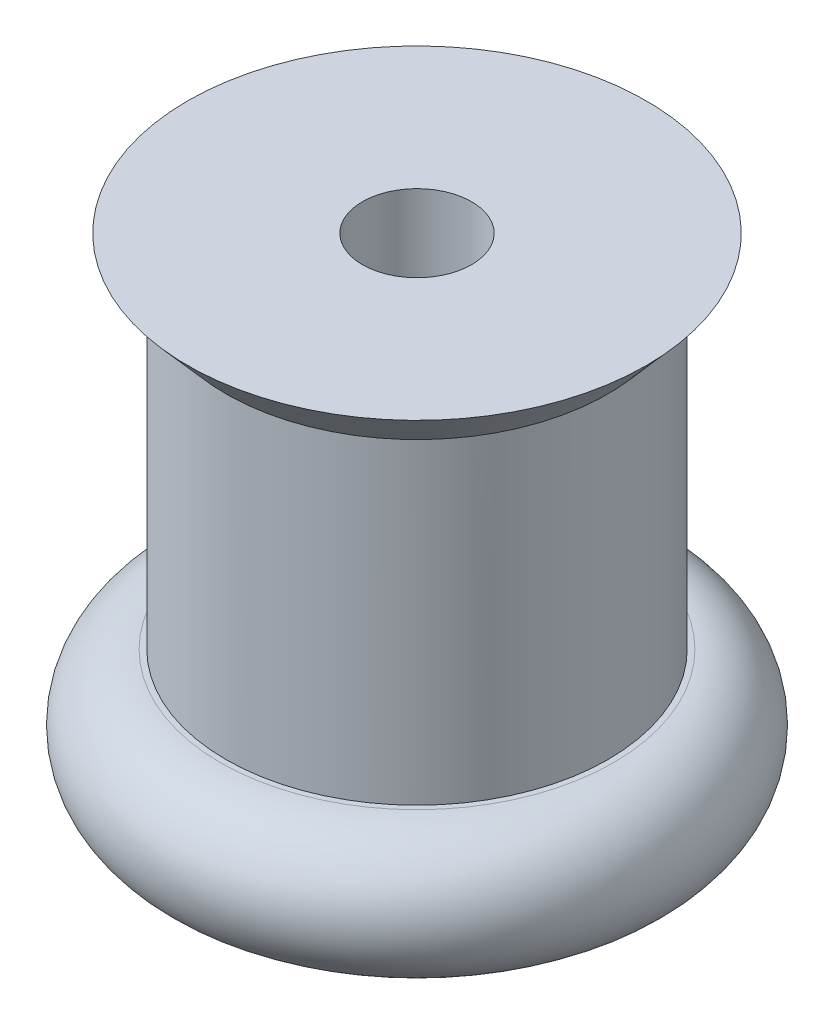
ISO-10303-21;
HEADER;
FILE_DESCRIPTION(('STEP AP214'),'2;1');
FILE_NAME('part.step','',(''),(''),'','','');
FILE_SCHEMA(('AUTOMOTIVE_DESIGN { 1 0 10303 214 1 1 1 1 }'));
ENDSEC;
DATA;
#1=APPLICATION_CONTEXT('core data for automotive mechanical design processes');
#2=APPLICATION_PROTOCOL_DEFINITION('international standard','automotive_design',2000,#1);
#3=PRODUCT_CONTEXT('',#1,'mechanical');
#4=PRODUCT('Part','Part','',(#3));
#5=PRODUCT_RELATED_PRODUCT_CATEGORY('part','',(#4));
#6=PRODUCT_DEFINITION_FORMATION('','',#4);
#7=PRODUCT_DEFINITION_CONTEXT('part definition',#1,'design');
#8=PRODUCT_DEFINITION('design','',#6,#7);
#9=PRODUCT_DEFINITION_SHAPE('','',#8);
#10=(LENGTH_UNIT() NAMED_UNIT(*) SI_UNIT(.MILLI.,.METRE.));
#11=(NAMED_UNIT(*) PLANE_ANGLE_UNIT() SI_UNIT($,.RADIAN.));
#12=(NAMED_UNIT(*) SI_UNIT($,.STERADIAN.) SOLID_ANGLE_UNIT());
#13=UNCERTAINTY_MEASURE_WITH_UNIT(LENGTH_MEASURE(1.E-05),#10,'distance_accuracy_value','');
#14=(GEOMETRIC_REPRESENTATION_CONTEXT(3) GLOBAL_UNCERTAINTY_ASSIGNED_CONTEXT((#13)) GLOBAL_UNIT_ASSIGNED_CONTEXT((#10,
#11,#12)) REPRESENTATION_CONTEXT('',''));
#15=CARTESIAN_POINT('',(0.,0.,0.));
#16=DIRECTION('',(0.,0.,1.));
#17=DIRECTION('',(1.,0.,0.));
#18=AXIS2_PLACEMENT_3D('',#15,#16,#17);
#19=CARTESIAN_POINT('',(0.,0.,0.));
#20=DIRECTION('',(0.,1.,0.));
#21=DIRECTION('',(0.,0.,1.));
#22=AXIS2_PLACEMENT_3D('',#19,#20,#21);
#23=PLANE('',#22);
#24=CARTESIAN_POINT('',(0.,0.,0.));
#25=DIRECTION('',(0.,1.,0.));
#26=DIRECTION('',(0.,0.,1.));
#27=AXIS2_PLACEMENT_3D('',#24,#25,#26);
#28=CIRCLE('',#27,2.5);
#29=CARTESIAN_POINT('',(0.,0.,2.5));
#30=VERTEX_POINT('',#29);
#31=EDGE_CURVE('E11',#30,#30,#28,.T.);
#32=ORIENTED_EDGE('',*,*,#31,.T.);
#33=EDGE_LOOP('',(#32));
#34=FACE_BOUND('',#33,.T.);
#35=CARTESIAN_POINT('',(0.,0.,0.));
#36=DIRECTION('',(0.,-1.,0.));
#37=DIRECTION('',(0.,0.,-1.));
#38=AXIS2_PLACEMENT_3D('',#35,#36,#37);
#39=CIRCLE('',#38,9.);
#40=CARTESIAN_POINT('',(-9.,0.,0.));
#41=VERTEX_POINT('',#40);
#42=EDGE_CURVE('E80',#41,#41,#39,.T.);
#43=ORIENTED_EDGE('',*,*,#42,.T.);
#44=EDGE_LOOP('',(#43));
#45=FACE_BOUND('',#44,.T.);
#46=ADVANCED_FACE('F33',(#34,#45),#23,.F.);
#47=CARTESIAN_POINT('',(0.,6.,0.));
#48=DIRECTION('',(0.,1.,0.));
#49=DIRECTION('',(0.,0.,1.));
#50=AXIS2_PLACEMENT_3D('',#47,#48,#49);
#51=PLANE('',#50);
#52=CARTESIAN_POINT('',(0.,6.,0.));
#53=DIRECTION('',(0.,1.,0.));
#54=DIRECTION('',(0.,0.,1.));
#55=AXIS2_PLACEMENT_3D('',#52,#53,#54);
#56=CIRCLE('',#55,8.75);
#57=CARTESIAN_POINT('',(0.,6.,8.75));
#58=VERTEX_POINT('',#57);
#59=EDGE_CURVE('E73',#58,#58,#56,.T.);
#60=ORIENTED_EDGE('',*,*,#59,.F.);
#61=EDGE_LOOP('',(#60));
#62=FACE_BOUND('',#61,.T.);
#63=CARTESIAN_POINT('',(0.,6.,0.));
#64=DIRECTION('',(0.,-1.,0.));
#65=DIRECTION('',(0.,0.,-1.));
#66=AXIS2_PLACEMENT_3D('',#63,#64,#65);
#67=CIRCLE('',#66,9.);
#68=CARTESIAN_POINT('',(-9.,6.,0.));
#69=VERTEX_POINT('',#68);
#70=EDGE_CURVE('E65',#69,#69,#67,.T.);
#71=ORIENTED_EDGE('',*,*,#70,.F.);
#72=EDGE_LOOP('',(#71));
#73=FACE_BOUND('',#72,.T.);
#74=ADVANCED_FACE('F92',(#62,#73),#51,.T.);
#75=CARTESIAN_POINT('',(0.,6.,0.));
#76=DIRECTION('',(0.,-1.,0.));
#77=DIRECTION('',(0.,0.,-1.));
#78=AXIS2_PLACEMENT_3D('',#75,#76,#77);
#79=CYLINDRICAL_SURFACE('',#78,2.5);
#80=ORIENTED_EDGE('',*,*,#31,.F.);
#81=EDGE_LOOP('',(#80));
#82=FACE_BOUND('',#81,.T.);
#83=CARTESIAN_POINT('',(0.,22.5,0.));
#84=DIRECTION('',(0.,1.,0.));
#85=DIRECTION('',(0.,0.,1.));
#86=AXIS2_PLACEMENT_3D('',#83,#84,#85);
#87=CIRCLE('',#86,2.5);
#88=CARTESIAN_POINT('',(0.,22.5,2.5));
#89=VERTEX_POINT('',#88);
#90=EDGE_CURVE('E64',#89,#89,#87,.T.);
#91=ORIENTED_EDGE('',*,*,#90,.T.);
#92=EDGE_LOOP('',(#91));
#93=FACE_BOUND('',#92,.T.);
#94=ADVANCED_FACE('F97',(#82,#93),#79,.F.);
#95=CARTESIAN_POINT('',(0.,20.5,0.));
#96=DIRECTION('',(0.,-1.,0.));
#97=DIRECTION('',(0.,0.,-1.));
#98=AXIS2_PLACEMENT_3D('',#95,#96,#97);
#99=CYLINDRICAL_SURFACE('',#98,8.75);
#100=CARTESIAN_POINT('',(0.,20.5,0.));
#101=DIRECTION('',(0.,1.,0.));
#102=DIRECTION('',(0.,0.,1.));
#103=AXIS2_PLACEMENT_3D('',#100,#101,#102);
#104=CIRCLE('',#103,8.75);
#105=CARTESIAN_POINT('',(-8.75,20.5,0.));
#106=VERTEX_POINT('',#105);
#107=EDGE_CURVE('E41',#106,#106,#104,.T.);
#108=ORIENTED_EDGE('',*,*,#107,.F.);
#109=EDGE_LOOP('',(#108));
#110=FACE_BOUND('',#109,.T.);
#111=ORIENTED_EDGE('',*,*,#59,.T.);
#112=EDGE_LOOP('',(#111));
#113=FACE_BOUND('',#112,.T.);
#114=ADVANCED_FACE('F103',(#110,#113),#99,.T.);
#115=CARTESIAN_POINT('',(0.,22.5,0.));
#116=DIRECTION('',(0.,1.,0.));
#117=DIRECTION('',(0.,0.,1.));
#118=AXIS2_PLACEMENT_3D('',#115,#116,#117);
#119=PLANE('',#118);
#120=CARTESIAN_POINT('',(0.,22.5,0.));
#121=DIRECTION('',(0.,1.,0.));
#122=DIRECTION('',(0.,0.,1.));
#123=AXIS2_PLACEMENT_3D('',#120,#121,#122);
#124=CIRCLE('',#123,10.5);
#125=CARTESIAN_POINT('',(-10.5,22.5,0.));
#126=VERTEX_POINT('',#125);
#127=EDGE_CURVE('E63',#126,#126,#124,.T.);
#128=ORIENTED_EDGE('',*,*,#127,.T.);
#129=EDGE_LOOP('',(#128));
#130=FACE_BOUND('',#129,.T.);
#131=ORIENTED_EDGE('',*,*,#90,.F.);
#132=EDGE_LOOP('',(#131));
#133=FACE_BOUND('',#132,.T.);
#134=ADVANCED_FACE('F89',(#130,#133),#119,.T.);
#135=CARTESIAN_POINT('',(0.,20.5,0.));
#136=DIRECTION('',(0.,1.,0.));
#137=DIRECTION('',(0.,0.,1.));
#138=AXIS2_PLACEMENT_3D('',#135,#136,#137);
#139=CONICAL_SURFACE('',#138,8.75,0.718829999621624);
#140=DIRECTION('',(-0.658504607868518,0.752576694706878,0.));
#141=VECTOR('',#140,1.);
#142=CARTESIAN_POINT('',(-10.5,22.5,0.));
#143=LINE('',#142,#141);
#144=EDGE_CURVE('E59',#106,#126,#143,.T.);
#145=ORIENTED_EDGE('',*,*,#144,.F.);
#146=ORIENTED_EDGE('',*,*,#107,.T.);
#147=ORIENTED_EDGE('',*,*,#144,.T.);
#148=ORIENTED_EDGE('',*,*,#127,.F.);
#149=EDGE_LOOP('',(#145,#146,#147,#148));
#150=FACE_BOUND('',#149,.T.);
#151=ADVANCED_FACE('F60',(#150),#139,.T.);
#152=CARTESIAN_POINT('',(0.,3.,0.));
#153=DIRECTION('',(0.,-1.,0.));
#154=DIRECTION('',(0.,0.,-1.));
#155=AXIS2_PLACEMENT_3D('',#152,#153,#154);
#156=TOROIDAL_SURFACE('',#155,9.,3.);
#157=CARTESIAN_POINT('',(-9.,3.,0.));
#158=DIRECTION('',(0.,0.,-1.));
#159=DIRECTION('',(1.,0.,0.));
#160=AXIS2_PLACEMENT_3D('',#157,#158,#159);
#161=CIRCLE('',#160,3.);
#162=EDGE_CURVE('E49',#41,#69,#161,.T.);
#163=ORIENTED_EDGE('',*,*,#162,.F.);
#164=ORIENTED_EDGE('',*,*,#42,.F.);
#165=ORIENTED_EDGE('',*,*,#162,.T.);
#166=ORIENTED_EDGE('',*,*,#70,.T.);
#167=EDGE_LOOP('',(#163,#164,#165,#166));
#168=FACE_BOUND('',#167,.T.);
#169=ADVANCED_FACE('F83',(#168),#156,.T.);
#170=CLOSED_SHELL('',(#46,#74,#94,#114,#134,#151,#169));
#171=MANIFOLD_SOLID_BREP('B2',#170);
#172=ADVANCED_BREP_SHAPE_REPRESENTATION('',(#18,#171),#14);
#173=SHAPE_DEFINITION_REPRESENTATION(#9,#172);
ENDSEC;
END-ISO-10303-21;
